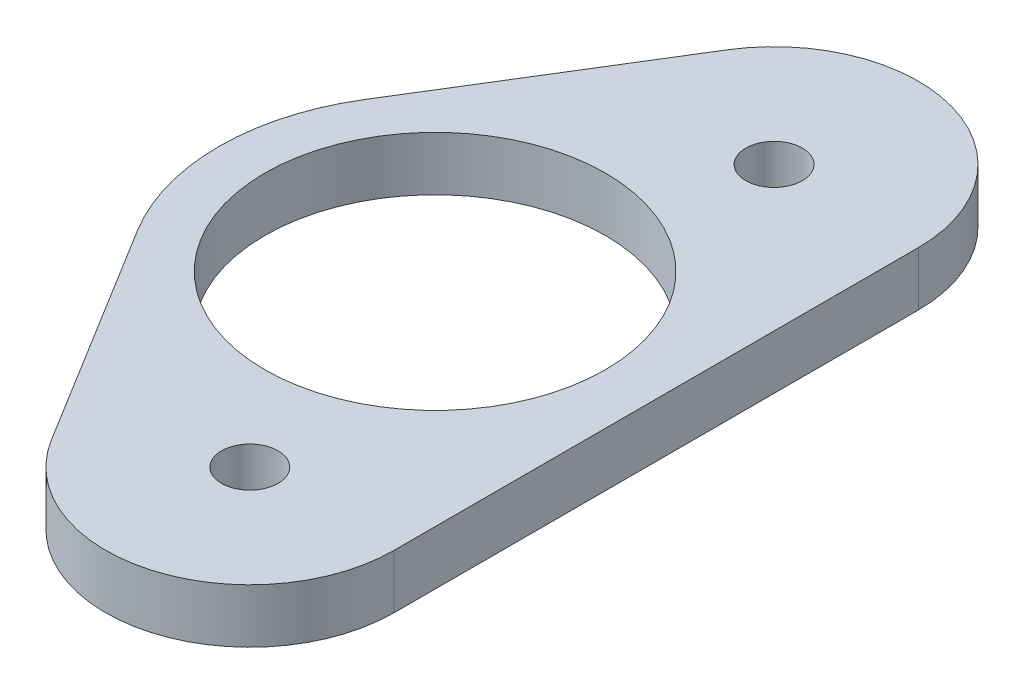
ISO-10303-21;
HEADER;
FILE_DESCRIPTION(('STEP AP214'),'2;1');
FILE_NAME('part.step','',(''),(''),'','','');
FILE_SCHEMA(('AUTOMOTIVE_DESIGN { 1 0 10303 214 1 1 1 1 }'));
ENDSEC;
DATA;
#1=APPLICATION_CONTEXT('core data for automotive mechanical design processes');
#2=APPLICATION_PROTOCOL_DEFINITION('international standard','automotive_design',2000,#1);
#3=PRODUCT_CONTEXT('',#1,'mechanical');
#4=PRODUCT('Part','Part','',(#3));
#5=PRODUCT_RELATED_PRODUCT_CATEGORY('part','',(#4));
#6=PRODUCT_DEFINITION_FORMATION('','',#4);
#7=PRODUCT_DEFINITION_CONTEXT('part definition',#1,'design');
#8=PRODUCT_DEFINITION('design','',#6,#7);
#9=PRODUCT_DEFINITION_SHAPE('','',#8);
#10=(LENGTH_UNIT() NAMED_UNIT(*) SI_UNIT(.MILLI.,.METRE.));
#11=(NAMED_UNIT(*) PLANE_ANGLE_UNIT() SI_UNIT($,.RADIAN.));
#12=(NAMED_UNIT(*) SI_UNIT($,.STERADIAN.) SOLID_ANGLE_UNIT());
#13=UNCERTAINTY_MEASURE_WITH_UNIT(LENGTH_MEASURE(1.E-05),#10,'distance_accuracy_value','');
#14=(GEOMETRIC_REPRESENTATION_CONTEXT(3) GLOBAL_UNCERTAINTY_ASSIGNED_CONTEXT((#13)) GLOBAL_UNIT_ASSIGNED_CONTEXT((#10,
#11,#12)) REPRESENTATION_CONTEXT('',''));
#15=CARTESIAN_POINT('',(0.,0.,0.));
#16=DIRECTION('',(0.,0.,1.));
#17=DIRECTION('',(1.,0.,0.));
#18=AXIS2_PLACEMENT_3D('',#15,#16,#17);
#19=CARTESIAN_POINT('',(-55.7330327987433,4.7625,-23.0853780574241));
#20=DIRECTION('',(0.,-1.,0.));
#21=DIRECTION('',(0.,0.,-1.));
#22=AXIS2_PLACEMENT_3D('',#19,#20,#21);
#23=CYLINDRICAL_SURFACE('',#22,12.7);
#24=CARTESIAN_POINT('',(-55.7330327987433,0.,-23.0853780574241));
#25=DIRECTION('',(0.,1.,0.));
#26=DIRECTION('',(0.,0.,1.));
#27=AXIS2_PLACEMENT_3D('',#24,#25,#26);
#28=CIRCLE('',#27,12.7);
#29=CARTESIAN_POINT('',(-43.0330327987433,0.,-23.0853780574241));
#30=VERTEX_POINT('',#29);
#31=CARTESIAN_POINT('',(-66.5450308388609,0.,-29.7480125499124));
#32=VERTEX_POINT('',#31);
#33=EDGE_CURVE('E133',#30,#32,#28,.T.);
#34=ORIENTED_EDGE('',*,*,#33,.T.);
#35=DIRECTION('',(0.,-1.,0.));
#36=VECTOR('',#35,1.);
#37=CARTESIAN_POINT('',(-66.5450308388609,4.7625,-29.7480125499124));
#38=LINE('',#37,#36);
#39=CARTESIAN_POINT('',(-66.5450308388609,4.7625,-29.7480125499124));
#40=VERTEX_POINT('',#39);
#41=EDGE_CURVE('E11',#40,#32,#38,.T.);
#42=ORIENTED_EDGE('',*,*,#41,.F.);
#43=CARTESIAN_POINT('',(-55.7330327987433,4.7625,-23.0853780574241));
#44=DIRECTION('',(0.,1.,0.));
#45=DIRECTION('',(0.,0.,1.));
#46=AXIS2_PLACEMENT_3D('',#43,#44,#45);
#47=CIRCLE('',#46,12.7);
#48=CARTESIAN_POINT('',(-43.0330327987433,4.7625,-23.0853780574241));
#49=VERTEX_POINT('',#48);
#50=EDGE_CURVE('E87',#49,#40,#47,.T.);
#51=ORIENTED_EDGE('',*,*,#50,.F.);
#52=DIRECTION('',(0.,-1.,0.));
#53=VECTOR('',#52,1.);
#54=CARTESIAN_POINT('',(-43.0330327987433,4.7625,-23.0853780574241));
#55=LINE('',#54,#53);
#56=EDGE_CURVE('E55',#49,#30,#55,.T.);
#57=ORIENTED_EDGE('',*,*,#56,.T.);
#58=EDGE_LOOP('',(#34,#42,#51,#57));
#59=FACE_BOUND('',#58,.T.);
#60=ADVANCED_FACE('F39',(#59),#23,.T.);
#61=CARTESIAN_POINT('',(-61.5165670348744,4.7625,-37.9081091085334));
#62=DIRECTION('',(-0.85133842835571,0.,-0.524616889172309));
#63=DIRECTION('',(-0.524616889172309,0.,0.85133842835571));
#64=AXIS2_PLACEMENT_3D('',#61,#62,#63);
#65=PLANE('',#64);
#66=DIRECTION('',(0.524616889172309,0.,-0.85133842835571));
#67=VECTOR('',#66,1.);
#68=CARTESIAN_POINT('',(-61.5165670348744,0.,-37.9081091085334));
#69=LINE('',#68,#67);
#70=CARTESIAN_POINT('',(-78.7179970601763,0.,-9.99395173873247));
#71=VERTEX_POINT('',#70);
#72=EDGE_CURVE('E135',#71,#32,#69,.T.);
#73=ORIENTED_EDGE('',*,*,#72,.F.);
#74=DIRECTION('',(0.,-1.,0.));
#75=VECTOR('',#74,1.);
#76=CARTESIAN_POINT('',(-78.7179970601763,4.7625,-9.99395173873247));
#77=LINE('',#76,#75);
#78=CARTESIAN_POINT('',(-78.7179970601763,4.7625,-9.99395173873247));
#79=VERTEX_POINT('',#78);
#80=EDGE_CURVE('E47',#79,#71,#77,.T.);
#81=ORIENTED_EDGE('',*,*,#80,.F.);
#82=DIRECTION('',(0.524616889172309,0.,-0.85133842835571));
#83=VECTOR('',#82,1.);
#84=CARTESIAN_POINT('',(-61.5165670348744,4.7625,-37.9081091085334));
#85=LINE('',#84,#83);
#86=EDGE_CURVE('E119',#79,#40,#85,.T.);
#87=ORIENTED_EDGE('',*,*,#86,.T.);
#88=ORIENTED_EDGE('',*,*,#41,.T.);
#89=EDGE_LOOP('',(#73,#81,#87,#88));
#90=FACE_BOUND('',#89,.T.);
#91=ADVANCED_FACE('F167',(#90),#65,.T.);
#92=CARTESIAN_POINT('',(-62.5,4.7625,0.));
#93=DIRECTION('',(0.,-1.,0.));
#94=DIRECTION('',(0.,0.,-1.));
#95=AXIS2_PLACEMENT_3D('',#92,#93,#94);
#96=CYLINDRICAL_SURFACE('',#95,19.05);
#97=CARTESIAN_POINT('',(-62.5,0.,0.));
#98=DIRECTION('',(0.,1.,0.));
#99=DIRECTION('',(0.,0.,1.));
#100=AXIS2_PLACEMENT_3D('',#97,#98,#99);
#101=CIRCLE('',#100,19.05);
#102=CARTESIAN_POINT('',(-78.7179970601763,0.,9.99395173873246));
#103=VERTEX_POINT('',#102);
#104=EDGE_CURVE('E138',#71,#103,#101,.T.);
#105=ORIENTED_EDGE('',*,*,#104,.T.);
#106=DIRECTION('',(0.,-1.,0.));
#107=VECTOR('',#106,1.);
#108=CARTESIAN_POINT('',(-78.7179970601763,4.7625,9.99395173873246));
#109=LINE('',#108,#107);
#110=CARTESIAN_POINT('',(-78.7179970601763,4.7625,9.99395173873246));
#111=VERTEX_POINT('',#110);
#112=EDGE_CURVE('E107',#111,#103,#109,.T.);
#113=ORIENTED_EDGE('',*,*,#112,.F.);
#114=CARTESIAN_POINT('',(-62.5,4.7625,0.));
#115=DIRECTION('',(0.,1.,0.));
#116=DIRECTION('',(0.,0.,1.));
#117=AXIS2_PLACEMENT_3D('',#114,#115,#116);
#118=CIRCLE('',#117,19.05);
#119=EDGE_CURVE('E116',#79,#111,#118,.T.);
#120=ORIENTED_EDGE('',*,*,#119,.F.);
#121=ORIENTED_EDGE('',*,*,#80,.T.);
#122=EDGE_LOOP('',(#105,#113,#120,#121));
#123=FACE_BOUND('',#122,.T.);
#124=ADVANCED_FACE('F160',(#123),#96,.T.);
#125=CARTESIAN_POINT('',(-61.5165670348744,4.7625,37.9081091085334));
#126=DIRECTION('',(-0.85133842835571,0.,0.524616889172308));
#127=DIRECTION('',(0.524616889172308,0.,0.85133842835571));
#128=AXIS2_PLACEMENT_3D('',#125,#126,#127);
#129=PLANE('',#128);
#130=DIRECTION('',(-0.524616889172308,0.,-0.85133842835571));
#131=VECTOR('',#130,1.);
#132=CARTESIAN_POINT('',(-61.5165670348744,0.,37.9081091085334));
#133=LINE('',#132,#131);
#134=CARTESIAN_POINT('',(-66.5450308388609,0.,29.7480125499124));
#135=VERTEX_POINT('',#134);
#136=EDGE_CURVE('E104',#135,#103,#133,.T.);
#137=ORIENTED_EDGE('',*,*,#136,.F.);
#138=DIRECTION('',(0.,-1.,0.));
#139=VECTOR('',#138,1.);
#140=CARTESIAN_POINT('',(-66.5450308388609,4.7625,29.7480125499124));
#141=LINE('',#140,#139);
#142=CARTESIAN_POINT('',(-66.5450308388609,4.7625,29.7480125499124));
#143=VERTEX_POINT('',#142);
#144=EDGE_CURVE('E98',#143,#135,#141,.T.);
#145=ORIENTED_EDGE('',*,*,#144,.F.);
#146=DIRECTION('',(-0.524616889172308,0.,-0.85133842835571));
#147=VECTOR('',#146,1.);
#148=CARTESIAN_POINT('',(-61.5165670348744,4.7625,37.9081091085334));
#149=LINE('',#148,#147);
#150=EDGE_CURVE('E102',#143,#111,#149,.T.);
#151=ORIENTED_EDGE('',*,*,#150,.T.);
#152=ORIENTED_EDGE('',*,*,#112,.T.);
#153=EDGE_LOOP('',(#137,#145,#151,#152));
#154=FACE_BOUND('',#153,.T.);
#155=ADVANCED_FACE('F100',(#154),#129,.T.);
#156=CARTESIAN_POINT('',(-55.7330327987434,4.7625,23.085378057424));
#157=DIRECTION('',(0.,-1.,0.));
#158=DIRECTION('',(0.,0.,-1.));
#159=AXIS2_PLACEMENT_3D('',#156,#157,#158);
#160=CYLINDRICAL_SURFACE('',#159,12.7);
#161=CARTESIAN_POINT('',(-55.7330327987434,0.,23.085378057424));
#162=DIRECTION('',(0.,1.,0.));
#163=DIRECTION('',(0.,0.,1.));
#164=AXIS2_PLACEMENT_3D('',#161,#162,#163);
#165=CIRCLE('',#164,12.7);
#166=CARTESIAN_POINT('',(-43.0330327987433,0.,23.0853780574241));
#167=VERTEX_POINT('',#166);
#168=EDGE_CURVE('E142',#135,#167,#165,.T.);
#169=ORIENTED_EDGE('',*,*,#168,.T.);
#170=DIRECTION('',(0.,-1.,0.));
#171=VECTOR('',#170,1.);
#172=CARTESIAN_POINT('',(-43.0330327987433,4.7625,23.0853780574241));
#173=LINE('',#172,#171);
#174=CARTESIAN_POINT('',(-43.0330327987433,4.7625,23.0853780574241));
#175=VERTEX_POINT('',#174);
#176=EDGE_CURVE('E75',#175,#167,#173,.T.);
#177=ORIENTED_EDGE('',*,*,#176,.F.);
#178=CARTESIAN_POINT('',(-55.7330327987434,4.7625,23.085378057424));
#179=DIRECTION('',(0.,1.,0.));
#180=DIRECTION('',(0.,0.,1.));
#181=AXIS2_PLACEMENT_3D('',#178,#179,#180);
#182=CIRCLE('',#181,12.7);
#183=EDGE_CURVE('E109',#143,#175,#182,.T.);
#184=ORIENTED_EDGE('',*,*,#183,.F.);
#185=ORIENTED_EDGE('',*,*,#144,.T.);
#186=EDGE_LOOP('',(#169,#177,#184,#185));
#187=FACE_BOUND('',#186,.T.);
#188=ADVANCED_FACE('F110',(#187),#160,.T.);
#189=CARTESIAN_POINT('',(-55.7330327987434,4.7625,23.0853780574241));
#190=DIRECTION('',(0.,-1.,0.));
#191=DIRECTION('',(0.,0.,-1.));
#192=AXIS2_PLACEMENT_3D('',#189,#190,#191);
#193=CYLINDRICAL_SURFACE('',#192,2.4892);
#194=CARTESIAN_POINT('',(-55.7330327987434,4.7625,23.0853780574241));
#195=DIRECTION('',(0.,1.,0.));
#196=DIRECTION('',(0.,0.,1.));
#197=AXIS2_PLACEMENT_3D('',#194,#195,#196);
#198=CIRCLE('',#197,2.4892);
#199=CARTESIAN_POINT('',(-55.7330327987434,4.7625,25.5745780574241));
#200=VERTEX_POINT('',#199);
#201=EDGE_CURVE('E127',#200,#200,#198,.T.);
#202=ORIENTED_EDGE('',*,*,#201,.T.);
#203=EDGE_LOOP('',(#202));
#204=FACE_BOUND('',#203,.T.);
#205=CARTESIAN_POINT('',(-55.7330327987434,0.,23.0853780574241));
#206=DIRECTION('',(0.,1.,0.));
#207=DIRECTION('',(0.,0.,1.));
#208=AXIS2_PLACEMENT_3D('',#205,#206,#207);
#209=CIRCLE('',#208,2.4892);
#210=CARTESIAN_POINT('',(-55.7330327987434,0.,25.5745780574241));
#211=VERTEX_POINT('',#210);
#212=EDGE_CURVE('E150',#211,#211,#209,.T.);
#213=ORIENTED_EDGE('',*,*,#212,.F.);
#214=EDGE_LOOP('',(#213));
#215=FACE_BOUND('',#214,.T.);
#216=ADVANCED_FACE('F179',(#204,#215),#193,.F.);
#217=CARTESIAN_POINT('',(-62.5,4.7625,0.));
#218=DIRECTION('',(0.,-1.,0.));
#219=DIRECTION('',(0.,0.,-1.));
#220=AXIS2_PLACEMENT_3D('',#217,#218,#219);
#221=CYLINDRICAL_SURFACE('',#220,15.);
#222=CARTESIAN_POINT('',(-62.5,4.7625,0.));
#223=DIRECTION('',(0.,1.,0.));
#224=DIRECTION('',(0.,0.,1.));
#225=AXIS2_PLACEMENT_3D('',#222,#223,#224);
#226=CIRCLE('',#225,15.);
#227=CARTESIAN_POINT('',(-62.5,4.7625,15.));
#228=VERTEX_POINT('',#227);
#229=EDGE_CURVE('E124',#228,#228,#226,.T.);
#230=ORIENTED_EDGE('',*,*,#229,.T.);
#231=EDGE_LOOP('',(#230));
#232=FACE_BOUND('',#231,.T.);
#233=CARTESIAN_POINT('',(-62.5,0.,0.));
#234=DIRECTION('',(0.,1.,0.));
#235=DIRECTION('',(0.,0.,1.));
#236=AXIS2_PLACEMENT_3D('',#233,#234,#235);
#237=CIRCLE('',#236,15.);
#238=CARTESIAN_POINT('',(-62.5,0.,15.));
#239=VERTEX_POINT('',#238);
#240=EDGE_CURVE('E147',#239,#239,#237,.T.);
#241=ORIENTED_EDGE('',*,*,#240,.F.);
#242=EDGE_LOOP('',(#241));
#243=FACE_BOUND('',#242,.T.);
#244=ADVANCED_FACE('F171',(#232,#243),#221,.F.);
#245=CARTESIAN_POINT('',(-43.0330327987433,4.7625,0.));
#246=DIRECTION('',(1.,0.,0.));
#247=DIRECTION('',(0.,0.,-1.));
#248=AXIS2_PLACEMENT_3D('',#245,#246,#247);
#249=PLANE('',#248);
#250=DIRECTION('',(0.,0.,1.));
#251=VECTOR('',#250,1.);
#252=CARTESIAN_POINT('',(-43.0330327987433,0.,0.));
#253=LINE('',#252,#251);
#254=EDGE_CURVE('E144',#30,#167,#253,.T.);
#255=ORIENTED_EDGE('',*,*,#254,.F.);
#256=ORIENTED_EDGE('',*,*,#56,.F.);
#257=DIRECTION('',(0.,0.,1.));
#258=VECTOR('',#257,1.);
#259=CARTESIAN_POINT('',(-43.0330327987433,4.7625,0.));
#260=LINE('',#259,#258);
#261=EDGE_CURVE('E111',#49,#175,#260,.T.);
#262=ORIENTED_EDGE('',*,*,#261,.T.);
#263=ORIENTED_EDGE('',*,*,#176,.T.);
#264=EDGE_LOOP('',(#255,#256,#262,#263));
#265=FACE_BOUND('',#264,.T.);
#266=ADVANCED_FACE('F168',(#265),#249,.T.);
#267=CARTESIAN_POINT('',(-55.7330327987434,4.7625,-23.0853780574241));
#268=DIRECTION('',(0.,-1.,0.));
#269=DIRECTION('',(0.,0.,-1.));
#270=AXIS2_PLACEMENT_3D('',#267,#268,#269);
#271=CYLINDRICAL_SURFACE('',#270,2.4892);
#272=CARTESIAN_POINT('',(-55.7330327987434,4.7625,-23.0853780574241));
#273=DIRECTION('',(0.,1.,0.));
#274=DIRECTION('',(0.,0.,1.));
#275=AXIS2_PLACEMENT_3D('',#272,#273,#274);
#276=CIRCLE('',#275,2.4892);
#277=CARTESIAN_POINT('',(-55.7330327987434,4.7625,-20.5961780574241));
#278=VERTEX_POINT('',#277);
#279=EDGE_CURVE('E130',#278,#278,#276,.T.);
#280=ORIENTED_EDGE('',*,*,#279,.T.);
#281=EDGE_LOOP('',(#280));
#282=FACE_BOUND('',#281,.T.);
#283=CARTESIAN_POINT('',(-55.7330327987434,0.,-23.0853780574241));
#284=DIRECTION('',(0.,1.,0.));
#285=DIRECTION('',(0.,0.,1.));
#286=AXIS2_PLACEMENT_3D('',#283,#284,#285);
#287=CIRCLE('',#286,2.4892);
#288=CARTESIAN_POINT('',(-55.7330327987434,0.,-20.5961780574241));
#289=VERTEX_POINT('',#288);
#290=EDGE_CURVE('E153',#289,#289,#287,.T.);
#291=ORIENTED_EDGE('',*,*,#290,.F.);
#292=EDGE_LOOP('',(#291));
#293=FACE_BOUND('',#292,.T.);
#294=ADVANCED_FACE('F170',(#282,#293),#271,.F.);
#295=CARTESIAN_POINT('',(0.,4.7625,0.));
#296=DIRECTION('',(0.,1.,0.));
#297=DIRECTION('',(0.,0.,1.));
#298=AXIS2_PLACEMENT_3D('',#295,#296,#297);
#299=PLANE('',#298);
#300=ORIENTED_EDGE('',*,*,#50,.T.);
#301=ORIENTED_EDGE('',*,*,#86,.F.);
#302=ORIENTED_EDGE('',*,*,#119,.T.);
#303=ORIENTED_EDGE('',*,*,#150,.F.);
#304=ORIENTED_EDGE('',*,*,#183,.T.);
#305=ORIENTED_EDGE('',*,*,#261,.F.);
#306=EDGE_LOOP('',(#300,#301,#302,#303,#304,#305));
#307=FACE_BOUND('',#306,.T.);
#308=ORIENTED_EDGE('',*,*,#229,.F.);
#309=EDGE_LOOP('',(#308));
#310=FACE_BOUND('',#309,.T.);
#311=ORIENTED_EDGE('',*,*,#201,.F.);
#312=EDGE_LOOP('',(#311));
#313=FACE_BOUND('',#312,.T.);
#314=ORIENTED_EDGE('',*,*,#279,.F.);
#315=EDGE_LOOP('',(#314));
#316=FACE_BOUND('',#315,.T.);
#317=ADVANCED_FACE('F113',(#307,#310,#313,#316),#299,.T.);
#318=CARTESIAN_POINT('',(0.,0.,0.));
#319=DIRECTION('',(0.,1.,0.));
#320=DIRECTION('',(0.,0.,1.));
#321=AXIS2_PLACEMENT_3D('',#318,#319,#320);
#322=PLANE('',#321);
#323=ORIENTED_EDGE('',*,*,#33,.F.);
#324=ORIENTED_EDGE('',*,*,#254,.T.);
#325=ORIENTED_EDGE('',*,*,#168,.F.);
#326=ORIENTED_EDGE('',*,*,#136,.T.);
#327=ORIENTED_EDGE('',*,*,#104,.F.);
#328=ORIENTED_EDGE('',*,*,#72,.T.);
#329=EDGE_LOOP('',(#323,#324,#325,#326,#327,#328));
#330=FACE_BOUND('',#329,.T.);
#331=ORIENTED_EDGE('',*,*,#240,.T.);
#332=EDGE_LOOP('',(#331));
#333=FACE_BOUND('',#332,.T.);
#334=ORIENTED_EDGE('',*,*,#212,.T.);
#335=EDGE_LOOP('',(#334));
#336=FACE_BOUND('',#335,.T.);
#337=ORIENTED_EDGE('',*,*,#290,.T.);
#338=EDGE_LOOP('',(#337));
#339=FACE_BOUND('',#338,.T.);
#340=ADVANCED_FACE('F165',(#330,#333,#336,#339),#322,.F.);
#341=CLOSED_SHELL('',(#60,#91,#124,#155,#188,#216,#244,#266,#294,#317,#340));
#342=MANIFOLD_SOLID_BREP('B2',#341);
#343=ADVANCED_BREP_SHAPE_REPRESENTATION('',(#18,#342),#14);
#344=SHAPE_DEFINITION_REPRESENTATION(#9,#343);
ENDSEC;
END-ISO-10303-21;
